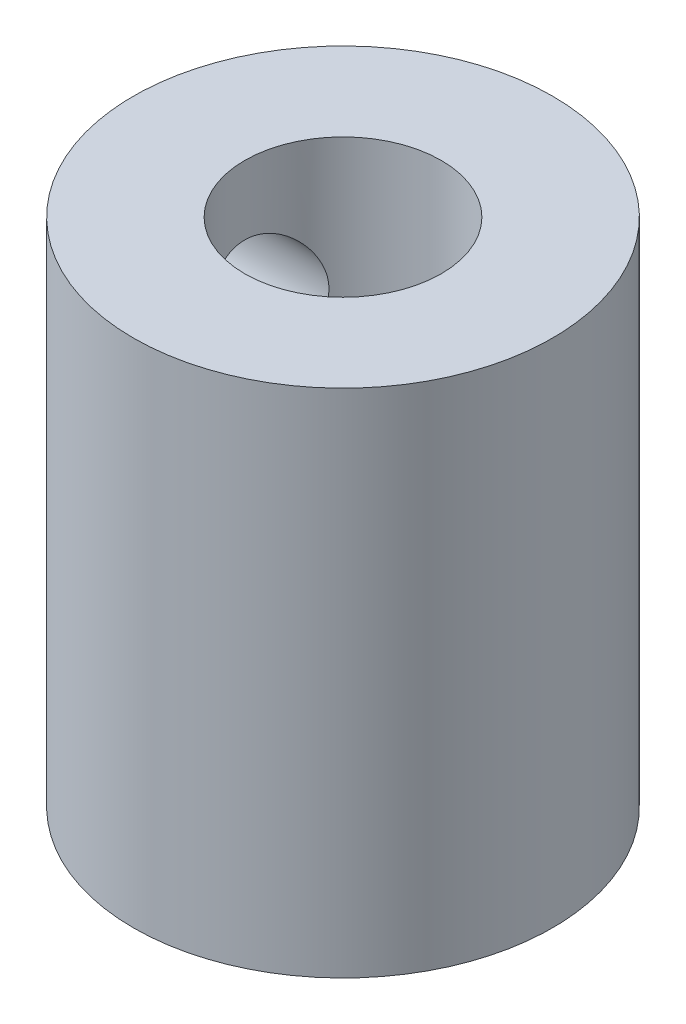
ISO-10303-21;
HEADER;
FILE_DESCRIPTION(('STEP AP214'),'2;1');
FILE_NAME('part.step','',(''),(''),'','','');
FILE_SCHEMA(('AUTOMOTIVE_DESIGN { 1 0 10303 214 1 1 1 1 }'));
ENDSEC;
DATA;
#1=APPLICATION_CONTEXT('core data for automotive mechanical design processes');
#2=APPLICATION_PROTOCOL_DEFINITION('international standard','automotive_design',2000,#1);
#3=PRODUCT_CONTEXT('',#1,'mechanical');
#4=PRODUCT('Part','Part','',(#3));
#5=PRODUCT_RELATED_PRODUCT_CATEGORY('part','',(#4));
#6=PRODUCT_DEFINITION_FORMATION('','',#4);
#7=PRODUCT_DEFINITION_CONTEXT('part definition',#1,'design');
#8=PRODUCT_DEFINITION('design','',#6,#7);
#9=PRODUCT_DEFINITION_SHAPE('','',#8);
#10=(LENGTH_UNIT() NAMED_UNIT(*) SI_UNIT(.MILLI.,.METRE.));
#11=(NAMED_UNIT(*) PLANE_ANGLE_UNIT() SI_UNIT($,.RADIAN.));
#12=(NAMED_UNIT(*) SI_UNIT($,.STERADIAN.) SOLID_ANGLE_UNIT());
#13=UNCERTAINTY_MEASURE_WITH_UNIT(LENGTH_MEASURE(1.E-05),#10,'distance_accuracy_value','');
#14=(GEOMETRIC_REPRESENTATION_CONTEXT(3) GLOBAL_UNCERTAINTY_ASSIGNED_CONTEXT((#13)) GLOBAL_UNIT_ASSIGNED_CONTEXT((#10,
#11,#12)) REPRESENTATION_CONTEXT('',''));
#15=CARTESIAN_POINT('',(0.,0.,0.));
#16=DIRECTION('',(0.,0.,1.));
#17=DIRECTION('',(1.,0.,0.));
#18=AXIS2_PLACEMENT_3D('',#15,#16,#17);
#19=CARTESIAN_POINT('',(0.,74.,0.));
#20=DIRECTION('',(0.,1.,0.));
#21=DIRECTION('',(0.,0.,1.));
#22=AXIS2_PLACEMENT_3D('',#19,#20,#21);
#23=PLANE('',#22);
#24=CARTESIAN_POINT('',(0.,74.,0.));
#25=DIRECTION('',(0.,1.,0.));
#26=DIRECTION('',(0.,0.,1.));
#27=AXIS2_PLACEMENT_3D('',#24,#25,#26);
#28=CIRCLE('',#27,1.3);
#29=CARTESIAN_POINT('',(0.,74.,1.3));
#30=VERTEX_POINT('',#29);
#31=EDGE_CURVE('E125',#30,#30,#28,.T.);
#32=ORIENTED_EDGE('',*,*,#31,.F.);
#33=EDGE_LOOP('',(#32));
#34=FACE_BOUND('',#33,.T.);
#35=CARTESIAN_POINT('',(0.,74.,0.));
#36=DIRECTION('',(0.,1.,0.));
#37=DIRECTION('',(0.,0.,1.));
#38=AXIS2_PLACEMENT_3D('',#35,#36,#37);
#39=CIRCLE('',#38,2.25);
#40=CARTESIAN_POINT('',(0.,74.,2.25));
#41=VERTEX_POINT('',#40);
#42=EDGE_CURVE('E120',#41,#41,#39,.T.);
#43=ORIENTED_EDGE('',*,*,#42,.T.);
#44=EDGE_LOOP('',(#43));
#45=FACE_BOUND('',#44,.T.);
#46=ADVANCED_FACE('F38',(#34,#45),#23,.T.);
#47=CARTESIAN_POINT('',(0.,68.5,0.));
#48=DIRECTION('',(0.,1.,0.));
#49=DIRECTION('',(0.,0.,1.));
#50=AXIS2_PLACEMENT_3D('',#47,#48,#49);
#51=CYLINDRICAL_SURFACE('',#50,4.8);
#52=CARTESIAN_POINT('',(-4.58440598551219,77.2,-1.4224));
#53=CARTESIAN_POINT('',(-4.58440687366464,77.2779905006927,-1.42239891024679));
#54=CARTESIAN_POINT('',(-4.58641793924929,77.355991817505,-1.41596382487332));
#55=CARTESIAN_POINT('',(-4.59421373007542,77.5097172059093,-1.39045776649108));
#56=CARTESIAN_POINT('',(-4.59999978679166,77.5854404641468,-1.37138233507659));
#57=CARTESIAN_POINT('',(-4.61463394781675,77.7323622891536,-1.32129758605142));
#58=CARTESIAN_POINT('',(-4.62347704915413,77.8035680250667,-1.29030775757673));
#59=CARTESIAN_POINT('',(-4.64322217958807,77.9397865957635,-1.21733763273041));
#60=CARTESIAN_POINT('',(-4.6541245004899,78.0047985508802,-1.17535577838866));
#61=CARTESIAN_POINT('',(-4.67713716934944,78.1287915154646,-1.08020560205211));
#62=CARTESIAN_POINT('',(-4.68927277510362,78.1875530051394,-1.02675726157922));
#63=CARTESIAN_POINT('',(-4.71316862128785,78.2954235318547,-0.910791650468689));
#64=CARTESIAN_POINT('',(-4.72492881446101,78.3445313576751,-0.848273243541642));
#65=CARTESIAN_POINT('',(-4.74703510482114,78.4326494203659,-0.714385081904498));
#66=CARTESIAN_POINT('',(-4.75734796804199,78.4714364756348,-0.642862473733131));
#67=CARTESIAN_POINT('',(-4.77510458655067,78.5363477833963,-0.493952506777122));
#68=CARTESIAN_POINT('',(-4.782548944764,78.5624746971969,-0.416566384529534));
#69=CARTESIAN_POINT('',(-4.79355107454164,78.6005994610664,-0.260422116318663));
#70=CARTESIAN_POINT('',(-4.79721167699415,78.6129718677134,-0.181762799484277));
#71=CARTESIAN_POINT('',(-4.80059567792808,78.6244200793448,-0.023405375230265));
#72=CARTESIAN_POINT('',(-4.80031988394474,78.6234986115116,0.0562925157786161));
#73=CARTESIAN_POINT('',(-4.79593516119315,78.6086380733585,0.211839448576014));
#74=CARTESIAN_POINT('',(-4.79194563935893,78.5951045029735,0.287731125190852));
#75=CARTESIAN_POINT('',(-4.78072635892506,78.5560654710242,0.436113343155239));
#76=CARTESIAN_POINT('',(-4.7734963970871,78.5305592585389,0.508603670859288));
#77=CARTESIAN_POINT('',(-4.75644215020036,78.4680203133292,0.649097520065643));
#78=CARTESIAN_POINT('',(-4.74658906549747,78.4308587543089,0.717040056335391));
#79=CARTESIAN_POINT('',(-4.7253356272962,78.346165524846,0.845855531253837));
#80=CARTESIAN_POINT('',(-4.71393491411564,78.2986314421749,0.906726820362723));
#81=CARTESIAN_POINT('',(-4.69030149611501,78.1924335425323,1.02209214025862));
#82=CARTESIAN_POINT('',(-4.67805362756766,78.133418074407,1.07625978478335));
#83=CARTESIAN_POINT('',(-4.6544829848975,78.0070205660565,1.17402028197632));
#84=CARTESIAN_POINT('',(-4.6431602981908,77.9396377367508,1.21761213615209));
#85=CARTESIAN_POINT('',(-4.62265078533774,77.7975766490759,1.29331303589592));
#86=CARTESIAN_POINT('',(-4.61348446437293,77.7228372425279,1.32531329027806));
#87=CARTESIAN_POINT('',(-4.59856985331081,77.5686961428649,1.37617801375682));
#88=CARTESIAN_POINT('',(-4.59282048004923,77.4892959359914,1.39504664587105));
#89=CARTESIAN_POINT('',(-4.58562767618114,77.331187355701,1.41850796927108));
#90=CARTESIAN_POINT('',(-4.58403499578078,77.2525591734428,1.42359573997852));
#91=CARTESIAN_POINT('',(-4.58492369314564,77.0955709907169,1.42073134399132));
#92=CARTESIAN_POINT('',(-4.58740451709816,77.0172109552447,1.41278094989874));
#93=CARTESIAN_POINT('',(-4.59601447010772,76.8650298241311,1.38450633605945));
#94=CARTESIAN_POINT('',(-4.60205023581054,76.7911441324238,1.36449847989358));
#95=CARTESIAN_POINT('',(-4.61699389597871,76.6477826452633,1.31304242587287));
#96=CARTESIAN_POINT('',(-4.62590222647684,76.5783075212173,1.28159249110727));
#97=CARTESIAN_POINT('',(-4.64587862915393,76.4437191179828,1.20719847446517));
#98=CARTESIAN_POINT('',(-4.65699734159412,76.3787686146305,1.16397384513195));
#99=CARTESIAN_POINT('',(-4.68003177915286,76.256861853643,1.06759224099293));
#100=CARTESIAN_POINT('',(-4.69194768992951,76.1999074678457,1.01443294731504));
#101=CARTESIAN_POINT('',(-4.71576310448261,76.0934569962283,0.897367705697397));
#102=CARTESIAN_POINT('',(-4.72764596090186,76.0443112864371,0.833138987540104));
#103=CARTESIAN_POINT('',(-4.74961511741224,75.9574884331214,0.697064415629587));
#104=CARTESIAN_POINT('',(-4.7597015082249,75.9198107103953,0.62521894681485));
#105=CARTESIAN_POINT('',(-4.77687885278478,75.8573564670008,0.476432286256445));
#106=CARTESIAN_POINT('',(-4.78399222477999,75.8324830518034,0.399534485203652));
#107=CARTESIAN_POINT('',(-4.79452106888227,75.7960906090417,0.242402496867359));
#108=CARTESIAN_POINT('',(-4.79793757092694,75.7845678619553,0.162169245302835));
#109=CARTESIAN_POINT('',(-4.80062662737086,75.7754811036243,0.00388569837194404));
#110=CARTESIAN_POINT('',(-4.8000502158879,75.777408359838,-0.0741331942562696));
#111=CARTESIAN_POINT('',(-4.7951725266697,75.7939547742537,-0.228687744416099));
#112=CARTESIAN_POINT('',(-4.79087145137399,75.8085732426745,-0.30522348232766));
#113=CARTESIAN_POINT('',(-4.77906933731412,75.8497750912238,-0.453877147547663));
#114=CARTESIAN_POINT('',(-4.7716015654011,75.8762342379227,-0.526032329670939));
#115=CARTESIAN_POINT('',(-4.75423899923001,75.9402554561604,-0.664917518160095));
#116=CARTESIAN_POINT('',(-4.74434381179487,75.9778193265727,-0.731646643314692));
#117=CARTESIAN_POINT('',(-4.72278151424752,76.0643531936247,-0.860063870335269));
#118=CARTESIAN_POINT('',(-4.71106849585137,76.1136445119723,-0.921527681751999));
#119=CARTESIAN_POINT('',(-4.68734167320662,76.2216519395478,-1.0354818476434));
#120=CARTESIAN_POINT('',(-4.67532778409133,76.2803707338442,-1.08796963680792));
#121=CARTESIAN_POINT('',(-4.65195207147274,76.4076014234107,-1.18400148547145));
#122=CARTESIAN_POINT('',(-4.64061908582834,76.4763471020146,-1.22724359724594));
#123=CARTESIAN_POINT('',(-4.62034370227742,76.6204572872996,-1.30150475851568));
#124=CARTESIAN_POINT('',(-4.61140010602696,76.6958184508429,-1.33252993884928));
#125=CARTESIAN_POINT('',(-4.59784268627801,76.842139113308,-1.37853178679187));
#126=CARTESIAN_POINT('',(-4.59285071504472,76.9126166157705,-1.39493785623814));
#127=CARTESIAN_POINT('',(-4.58613226087978,77.0553932104654,-1.41687144215756));
#128=CARTESIAN_POINT('',(-4.58440516207132,77.1276919565352,-1.42240101035283));
#129=CARTESIAN_POINT('',(-4.58440598551219,77.2,-1.4224));
#130=B_SPLINE_CURVE_WITH_KNOTS('',3,(#52,#53,#54,#55,#56,#57,#58,#59,#60,#61,#62,#63,#64,#65,
#66,#67,#68,#69,#70,#71,#72,#73,#74,#75,#76,#77,#78,#79,#80,#81,#82,#83,#84,#85,#86,#87,#88,#89,
#90,#91,#92,#93,#94,#95,#96,#97,#98,#99,#100,#101,#102,#103,#104,#105,#106,#107,#108,#109,#110,
#111,#112,#113,#114,#115,#116,#117,#118,#119,#120,#121,#122,#123,#124,#125,#126,#127,#128,#129),
.UNSPECIFIED.,.T.,.F.,(4,2,2,2,2,2,2,2,2,2,2,2,2,2,2,2,2,2,2,2,2,2,2,2,2,2,2,2,2,2,2,2,2,2,2,2,
2,2,4),(0.,0.233704869835653,0.467492214164043,0.700898753676049,0.934338393314703,
1.17430671263044,1.41430512095347,1.65913505132481,1.90391349326264,2.14184922505593,
2.37973614603129,2.61022912772106,2.84073656780623,3.07388735370554,3.30709241892286,
3.54907757111414,3.79108556097518,4.03530937960445,4.27945573851537,4.51470693140373,
4.74992614339722,4.97922714197314,5.2085629630383,5.44393043257004,5.67935290851711,
5.9234142793636,6.16746332161047,6.40963736174927,6.6517439154938,6.88474403635868,
7.11773149420756,7.34832974339981,7.57896536809526,7.816848198767,8.05479890216274,
8.29961914080654,8.54431636394445,8.76103417430858,8.97771109952283),.UNSPECIFIED.);
#131=CARTESIAN_POINT('',(-4.58440598551219,77.2,-1.4224));
#132=VERTEX_POINT('',#131);
#133=EDGE_CURVE('E114',#132,#132,#130,.T.);
#134=ORIENTED_EDGE('',*,*,#133,.T.);
#135=EDGE_LOOP('',(#134));
#136=FACE_BOUND('',#135,.T.);
#137=CARTESIAN_POINT('',(-4.58440598551219,71.5,-1.4224));
#138=CARTESIAN_POINT('',(-4.58440687366464,71.5779905006927,-1.42239891024679));
#139=CARTESIAN_POINT('',(-4.58641793924929,71.655991817505,-1.41596382487332));
#140=CARTESIAN_POINT('',(-4.59421373007542,71.8097172059093,-1.39045776649108));
#141=CARTESIAN_POINT('',(-4.59999978679166,71.8854404641468,-1.37138233507659));
#142=CARTESIAN_POINT('',(-4.61463394781675,72.0323622891536,-1.32129758605142));
#143=CARTESIAN_POINT('',(-4.62347704915413,72.1035680250667,-1.29030775757673));
#144=CARTESIAN_POINT('',(-4.64322217958807,72.2397865957635,-1.2173376327304));
#145=CARTESIAN_POINT('',(-4.6541245004899,72.3047985508802,-1.17535577838866));
#146=CARTESIAN_POINT('',(-4.67713716934944,72.4287915154646,-1.08020560205211));
#147=CARTESIAN_POINT('',(-4.68927277510362,72.4875530051394,-1.02675726157922));
#148=CARTESIAN_POINT('',(-4.71316862128785,72.5954235318547,-0.910791650468689));
#149=CARTESIAN_POINT('',(-4.72492881446101,72.6445313576751,-0.848273243541642));
#150=CARTESIAN_POINT('',(-4.74703510482114,72.7326494203659,-0.714385081904498));
#151=CARTESIAN_POINT('',(-4.75734796804199,72.7714364756348,-0.642862473733131));
#152=CARTESIAN_POINT('',(-4.77510458655067,72.8363477833963,-0.493952506777122));
#153=CARTESIAN_POINT('',(-4.782548944764,72.8624746971969,-0.416566384529534));
#154=CARTESIAN_POINT('',(-4.79355107454164,72.9005994610664,-0.260422116318662));
#155=CARTESIAN_POINT('',(-4.79721167699415,72.9129718677134,-0.181762799484276));
#156=CARTESIAN_POINT('',(-4.80059567792808,72.9244200793448,-0.0234053752302643));
#157=CARTESIAN_POINT('',(-4.80031988394474,72.9234986115116,0.0562925157786165));
#158=CARTESIAN_POINT('',(-4.79593516119315,72.9086380733585,0.211839448576014));
#159=CARTESIAN_POINT('',(-4.79194563935893,72.8951045029735,0.287731125190852));
#160=CARTESIAN_POINT('',(-4.78072635892506,72.8560654710243,0.436113343155239));
#161=CARTESIAN_POINT('',(-4.7734963970871,72.8305592585389,0.508603670859288));
#162=CARTESIAN_POINT('',(-4.75644215020036,72.7680203133292,0.64909752006564));
#163=CARTESIAN_POINT('',(-4.74658906549747,72.7308587543089,0.717040056335386));
#164=CARTESIAN_POINT('',(-4.72533562729621,72.646165524846,0.845855531253833));
#165=CARTESIAN_POINT('',(-4.71393491411564,72.5986314421749,0.906726820362721));
#166=CARTESIAN_POINT('',(-4.69030149611501,72.4924335425323,1.02209214025862));
#167=CARTESIAN_POINT('',(-4.67805362756766,72.433418074407,1.07625978478335));
#168=CARTESIAN_POINT('',(-4.6544829848975,72.3070205660566,1.17402028197632));
#169=CARTESIAN_POINT('',(-4.6431602981908,72.2396377367508,1.21761213615209));
#170=CARTESIAN_POINT('',(-4.62265078533774,72.0975766490759,1.29331303589593));
#171=CARTESIAN_POINT('',(-4.61348446437293,72.0228372425279,1.32531329027806));
#172=CARTESIAN_POINT('',(-4.5985698533108,71.8686961428649,1.37617801375682));
#173=CARTESIAN_POINT('',(-4.59282048004923,71.7892959359914,1.39504664587105));
#174=CARTESIAN_POINT('',(-4.58562767618114,71.631187355701,1.41850796927109));
#175=CARTESIAN_POINT('',(-4.58403499578078,71.5525591734428,1.42359573997852));
#176=CARTESIAN_POINT('',(-4.58492369314564,71.3955709907169,1.42073134399132));
#177=CARTESIAN_POINT('',(-4.58740451709816,71.3172109552447,1.41278094989874));
#178=CARTESIAN_POINT('',(-4.59601447010772,71.1650298241311,1.38450633605945));
#179=CARTESIAN_POINT('',(-4.60205023581054,71.0911441324238,1.36449847989358));
#180=CARTESIAN_POINT('',(-4.61699389597871,70.9477826452634,1.31304242587287));
#181=CARTESIAN_POINT('',(-4.62590222647684,70.8783075212173,1.28159249110727));
#182=CARTESIAN_POINT('',(-4.64587862915393,70.7437191179828,1.20719847446517));
#183=CARTESIAN_POINT('',(-4.65699734159412,70.6787686146305,1.16397384513195));
#184=CARTESIAN_POINT('',(-4.68003177915286,70.556861853643,1.06759224099293));
#185=CARTESIAN_POINT('',(-4.69194768992951,70.4999074678457,1.01443294731504));
#186=CARTESIAN_POINT('',(-4.71576310448261,70.3934569962283,0.897367705697394));
#187=CARTESIAN_POINT('',(-4.72764596090186,70.3443112864371,0.833138987540099));
#188=CARTESIAN_POINT('',(-4.74961511741224,70.2574884331215,0.697064415629582));
#189=CARTESIAN_POINT('',(-4.7597015082249,70.2198107103953,0.625218946814848));
#190=CARTESIAN_POINT('',(-4.77687885278478,70.1573564670008,0.476432286256445));
#191=CARTESIAN_POINT('',(-4.78399222477999,70.1324830518034,0.399534485203652));
#192=CARTESIAN_POINT('',(-4.79452106888227,70.0960906090417,0.242402496867359));
#193=CARTESIAN_POINT('',(-4.79793757092694,70.0845678619553,0.162169245302836));
#194=CARTESIAN_POINT('',(-4.80062662737086,70.0754811036243,0.00388569837194345));
#195=CARTESIAN_POINT('',(-4.8000502158879,70.077408359838,-0.0741331942562709));
#196=CARTESIAN_POINT('',(-4.7951725266697,70.0939547742537,-0.2286877444161));
#197=CARTESIAN_POINT('',(-4.79087145137399,70.1085732426745,-0.305223482327659));
#198=CARTESIAN_POINT('',(-4.77906933731412,70.1497750912238,-0.453877147547661));
#199=CARTESIAN_POINT('',(-4.7716015654011,70.1762342379227,-0.526032329670937));
#200=CARTESIAN_POINT('',(-4.75423899923001,70.2402554561603,-0.664917518160093));
#201=CARTESIAN_POINT('',(-4.74434381179487,70.2778193265727,-0.73164664331469));
#202=CARTESIAN_POINT('',(-4.72278151424752,70.3643531936247,-0.860063870335268));
#203=CARTESIAN_POINT('',(-4.71106849585137,70.4136445119723,-0.921527681751999));
#204=CARTESIAN_POINT('',(-4.68734167320662,70.5216519395478,-1.0354818476434));
#205=CARTESIAN_POINT('',(-4.67532778409133,70.5803707338442,-1.08796963680792));
#206=CARTESIAN_POINT('',(-4.65195207147274,70.7076014234107,-1.18400148547144));
#207=CARTESIAN_POINT('',(-4.64061908582834,70.7763471020147,-1.22724359724594));
#208=CARTESIAN_POINT('',(-4.62034370227742,70.9204572872996,-1.30150475851568));
#209=CARTESIAN_POINT('',(-4.61140010602696,70.9958184508429,-1.33252993884928));
#210=CARTESIAN_POINT('',(-4.59784268627801,71.142139113308,-1.37853178679186));
#211=CARTESIAN_POINT('',(-4.59285071504472,71.2126166157706,-1.39493785623813));
#212=CARTESIAN_POINT('',(-4.58613226087978,71.3553932104654,-1.41687144215756));
#213=CARTESIAN_POINT('',(-4.58440516207132,71.4276919565352,-1.42240101035283));
#214=CARTESIAN_POINT('',(-4.58440598551219,71.5,-1.4224));
#215=B_SPLINE_CURVE_WITH_KNOTS('',3,(#137,#138,#139,#140,#141,#142,#143,#144,#145,#146,#147,
#148,#149,#150,#151,#152,#153,#154,#155,#156,#157,#158,#159,#160,#161,#162,#163,#164,#165,#166,
#167,#168,#169,#170,#171,#172,#173,#174,#175,#176,#177,#178,#179,#180,#181,#182,#183,#184,#185,
#186,#187,#188,#189,#190,#191,#192,#193,#194,#195,#196,#197,#198,#199,#200,#201,#202,#203,#204,
#205,#206,#207,#208,#209,#210,#211,#212,#213,#214),.UNSPECIFIED.,.T.,.F.,(4,2,2,2,2,2,2,2,2,2,2,
2,2,2,2,2,2,2,2,2,2,2,2,2,2,2,2,2,2,2,2,2,2,2,2,2,2,2,4),(0.,0.233704869835653,
0.467492214164043,0.700898753676064,0.934338393314703,1.17430671263044,1.41430512095347,
1.65913505132481,1.90391349326264,2.14184922505593,2.37973614603129,2.61022912772106,
2.84073656780623,3.07388735370553,3.30709241892286,3.54907757111414,3.79108556097517,
4.03530937960446,4.27945573851536,4.51470693140375,4.74992614339722,4.97922714197314,
5.20856296303829,5.44393043257005,5.67935290851711,5.92341427936361,6.16746332161047,
6.40963736174927,6.6517439154938,6.88474403635869,7.11773149420756,7.3483297433998,
7.57896536809526,7.81684819876701,8.05479890216274,8.29961914080653,8.54431636394446,
8.76103417430857,8.97771109952284),.UNSPECIFIED.);
#216=CARTESIAN_POINT('',(-4.58440598551219,71.5,-1.4224));
#217=VERTEX_POINT('',#216);
#218=EDGE_CURVE('E79',#217,#217,#215,.T.);
#219=ORIENTED_EDGE('',*,*,#218,.T.);
#220=EDGE_LOOP('',(#219));
#221=FACE_BOUND('',#220,.T.);
#222=CARTESIAN_POINT('',(0.,68.5,0.));
#223=DIRECTION('',(0.,1.,0.));
#224=DIRECTION('',(0.,0.,1.));
#225=AXIS2_PLACEMENT_3D('',#222,#223,#224);
#226=CIRCLE('',#225,4.8);
#227=CARTESIAN_POINT('',(0.,68.5,4.8));
#228=VERTEX_POINT('',#227);
#229=EDGE_CURVE('E75',#228,#228,#226,.T.);
#230=ORIENTED_EDGE('',*,*,#229,.T.);
#231=EDGE_LOOP('',(#230));
#232=FACE_BOUND('',#231,.T.);
#233=CARTESIAN_POINT('',(0.,80.2,0.));
#234=DIRECTION('',(0.,1.,0.));
#235=DIRECTION('',(0.,0.,1.));
#236=AXIS2_PLACEMENT_3D('',#233,#234,#235);
#237=CIRCLE('',#236,4.8);
#238=CARTESIAN_POINT('',(0.,80.2,4.8));
#239=VERTEX_POINT('',#238);
#240=EDGE_CURVE('E119',#239,#239,#237,.T.);
#241=ORIENTED_EDGE('',*,*,#240,.F.);
#242=EDGE_LOOP('',(#241));
#243=FACE_BOUND('',#242,.T.);
#244=ADVANCED_FACE('F40',(#136,#221,#232,#243),#51,.T.);
#245=CARTESIAN_POINT('',(0.,68.5,0.));
#246=DIRECTION('',(0.,1.,0.));
#247=DIRECTION('',(0.,0.,1.));
#248=AXIS2_PLACEMENT_3D('',#245,#246,#247);
#249=PLANE('',#248);
#250=CARTESIAN_POINT('',(0.,68.5,0.));
#251=DIRECTION('',(0.,1.,0.));
#252=DIRECTION('',(0.,0.,1.));
#253=AXIS2_PLACEMENT_3D('',#250,#251,#252);
#254=CIRCLE('',#253,1.3);
#255=CARTESIAN_POINT('',(0.,68.5,1.3));
#256=VERTEX_POINT('',#255);
#257=EDGE_CURVE('E126',#256,#256,#254,.T.);
#258=ORIENTED_EDGE('',*,*,#257,.T.);
#259=EDGE_LOOP('',(#258));
#260=FACE_BOUND('',#259,.T.);
#261=ORIENTED_EDGE('',*,*,#229,.F.);
#262=EDGE_LOOP('',(#261));
#263=FACE_BOUND('',#262,.T.);
#264=ADVANCED_FACE('F135',(#260,#263),#249,.F.);
#265=CARTESIAN_POINT('',(0.,68.5,0.));
#266=DIRECTION('',(0.,1.,0.));
#267=DIRECTION('',(0.,0.,1.));
#268=AXIS2_PLACEMENT_3D('',#265,#266,#267);
#269=CYLINDRICAL_SURFACE('',#268,1.3);
#270=DIRECTION('',(0.,1.,0.));
#271=VECTOR('',#270,1.);
#272=CARTESIAN_POINT('',(0.,68.5,-1.3));
#273=LINE('',#272,#271);
#274=CARTESIAN_POINT('',(0.,72.0772536357616,-1.3));
#275=VERTEX_POINT('',#274);
#276=CARTESIAN_POINT('',(0.,70.9227463642384,-1.3));
#277=VERTEX_POINT('',#276);
#278=EDGE_CURVE('E51',#275,#277,#273,.F.);
#279=ORIENTED_EDGE('',*,*,#278,.T.);
#280=CARTESIAN_POINT('',(0.,70.9227463642384,1.3));
#281=CARTESIAN_POINT('',(0.037229920825782,70.9227390867436,1.29999800896622));
#282=CARTESIAN_POINT('',(0.0744727451855851,70.9190512162519,1.29837708508441));
#283=CARTESIAN_POINT('',(0.147550426951959,70.905286769958,1.29212592012174));
#284=CARTESIAN_POINT('',(0.183378584917671,70.8951829507732,1.28748284427356));
#285=CARTESIAN_POINT('',(0.27057345147867,70.8643839662859,1.27264459312184));
#286=CARTESIAN_POINT('',(0.320636163345426,70.8409166425736,1.26082913055967));
#287=CARTESIAN_POINT('',(0.416772115126733,70.7891716764003,1.23240754282416));
#288=CARTESIAN_POINT('',(0.462828534486893,70.7608751032262,1.21578237809696));
#289=CARTESIAN_POINT('',(0.547133951488667,70.705209350752,1.18004774033849));
#290=CARTESIAN_POINT('',(0.585699693102884,70.6780413149372,1.16136625882408));
#291=CARTESIAN_POINT('',(0.660521558896348,70.6231489682111,1.12050415642257));
#292=CARTESIAN_POINT('',(0.696776082052551,70.5954242888149,1.09832114615709));
#293=CARTESIAN_POINT('',(0.80215342362391,70.5127038454654,1.02653578674185));
#294=CARTESIAN_POINT('',(0.868077162574186,70.4580286874785,0.97161725206705));
#295=CARTESIAN_POINT('',(0.974648102025588,70.3674744236537,0.862734543572929));
#296=CARTESIAN_POINT('',(1.01749329042917,70.3303145166331,0.811967334339006));
#297=CARTESIAN_POINT('',(1.09618131030284,70.2612612307245,0.702093342856163));
#298=CARTESIAN_POINT('',(1.13203634139725,70.2293586917119,0.643001405698947));
#299=CARTESIAN_POINT('',(1.18855548318103,70.1787261755928,0.529625238340446));
#300=CARTESIAN_POINT('',(1.21082402348386,70.158637575282,0.476753301676627));
#301=CARTESIAN_POINT('',(1.24854174366894,70.1244952919047,0.366763166700666));
#302=CARTESIAN_POINT('',(1.26399496496797,70.1104380324474,0.309647508418384));
#303=CARTESIAN_POINT('',(1.28711827277876,70.0893716542412,0.192170531569941));
#304=CARTESIAN_POINT('',(1.29473770244525,70.0824084112156,0.131790713540568));
#305=CARTESIAN_POINT('',(1.30138381337991,70.0763358865969,0.0101708279667989));
#306=CARTESIAN_POINT('',(1.30041396528006,70.0772234327695,-0.0510688821389404));
#307=CARTESIAN_POINT('',(1.29052982848868,70.0862511198338,-0.165838369051285));
#308=CARTESIAN_POINT('',(1.28245487763397,70.0936249935907,-0.219505983026455));
#309=CARTESIAN_POINT('',(1.26002331443776,70.1140493811884,-0.324373271422287));
#310=CARTESIAN_POINT('',(1.24566555657089,70.1271009302202,-0.375572493897755));
#311=CARTESIAN_POINT('',(1.21063917546339,70.1588025671274,-0.476820190034594));
#312=CARTESIAN_POINT('',(1.18970664258891,70.1776860877072,-0.526702660410553));
#313=CARTESIAN_POINT('',(1.14276366930395,70.2197565553878,-0.622028051568684));
#314=CARTESIAN_POINT('',(1.11675115371357,70.242945260971,-0.66746914662179));
#315=CARTESIAN_POINT('',(1.04567714831206,70.3057429443618,-0.776358700518016));
#316=CARTESIAN_POINT('',(0.997795577608096,70.3475706950305,-0.836697115256757));
#317=CARTESIAN_POINT('',(0.894323115090796,70.4359004455815,-0.946526656031954));
#318=CARTESIAN_POINT('',(0.838706827897944,70.482417698123,-0.995980604285597));
#319=CARTESIAN_POINT('',(0.719426518595297,70.5783393107332,-1.08541905762389));
#320=CARTESIAN_POINT('',(0.655596866014293,70.6277866887289,-1.12513773392775));
#321=CARTESIAN_POINT('',(0.554444692691118,70.6999424923697,-1.17643863667231));
#322=CARTESIAN_POINT('',(0.519861569287101,70.7236369100696,-1.19214836876454));
#323=CARTESIAN_POINT('',(0.44857804166351,70.769458203281,-1.2207595688405));
#324=CARTESIAN_POINT('',(0.411880068537188,70.7915868160023,-1.23366418303845));
#325=CARTESIAN_POINT('',(0.34162048048624,70.8297809728255,-1.25476349914674));
#326=CARTESIAN_POINT('',(0.308412073947594,70.8462582314119,-1.26337411543101));
#327=CARTESIAN_POINT('',(0.239928013156155,70.8756322727769,-1.27814573805229));
#328=CARTESIAN_POINT('',(0.204656507503199,70.8885359607286,-1.28431147869876));
#329=CARTESIAN_POINT('',(0.138263196841614,70.9071200934823,-1.29298269984334));
#330=CARTESIAN_POINT('',(0.107447803222823,70.9136528424178,-1.29593072973269));
#331=CARTESIAN_POINT('',(0.0450605513490195,70.9218104195926,-1.29959257343409));
#332=CARTESIAN_POINT('',(0.0134901980209997,70.9234443051364,-1.30031051046068));
#333=CARTESIAN_POINT('',(-0.0494653727520491,70.9214880560041,-1.29944059078731));
#334=CARTESIAN_POINT('',(-0.080850463797194,70.917894693928,-1.29785130956913));
#335=CARTESIAN_POINT('',(-0.142591887368654,70.9061743985114,-1.2925296535671));
#336=CARTESIAN_POINT('',(-0.172945811422518,70.8980375346513,-1.28879258393707));
#337=CARTESIAN_POINT('',(-0.251897385229396,70.8719128528675,-1.27634092250748));
#338=CARTESIAN_POINT('',(-0.299223726155425,70.8509716082578,-1.26596891359934));
#339=CARTESIAN_POINT('',(-0.39028975382781,70.8042920528674,-1.24093580710319));
#340=CARTESIAN_POINT('',(-0.434011628720845,70.7785317621829,-1.22625487441409));
#341=CARTESIAN_POINT('',(-0.516042973786058,70.7263140481999,-1.19395253252606));
#342=CARTESIAN_POINT('',(-0.554519076708286,70.6999816431386,-1.17654843990756));
#343=CARTESIAN_POINT('',(-0.629188828391355,70.6465216221415,-1.13836745390987));
#344=CARTESIAN_POINT('',(-0.665380705860889,70.6193934124104,-1.11758798666943));
#345=CARTESIAN_POINT('',(-0.770714334210021,70.5381273691464,-1.05021588097305));
#346=CARTESIAN_POINT('',(-0.836757009385205,70.4840093934151,-0.998532551614578));
#347=CARTESIAN_POINT('',(-0.946618973884808,70.3915499351499,-0.893529026106998));
#348=CARTESIAN_POINT('',(-0.992190448823296,70.3522848156573,-0.842841266270909));
#349=CARTESIAN_POINT('',(-1.0761738432295,70.278956457161,-0.732553671953606));
#350=CARTESIAN_POINT('',(-1.11459942210383,70.2448833166774,-0.672971241207999));
#351=CARTESIAN_POINT('',(-1.17502581347027,70.1908900850246,-0.559042814593396));
#352=CARTESIAN_POINT('',(-1.19878170654618,70.1695022230114,-0.506329373695333));
#353=CARTESIAN_POINT('',(-1.23949254132734,70.1327082468929,-0.396343712748666));
#354=CARTESIAN_POINT('',(-1.25645136565041,70.117298718009,-0.339074117736606));
#355=CARTESIAN_POINT('',(-1.28253535130243,70.0935543536836,-0.220878175725918));
#356=CARTESIAN_POINT('',(-1.29160432439621,70.0852702673235,-0.159928853428477));
#357=CARTESIAN_POINT('',(-1.30094168790503,70.0767406794139,-0.0368074714629449));
#358=CARTESIAN_POINT('',(-1.30121479157148,70.0764908727097,0.0253639154913668));
#359=CARTESIAN_POINT('',(-1.293429451794,70.0836032119979,0.14157448614114));
#360=CARTESIAN_POINT('',(-1.28631372267579,70.0901040695057,0.195735331907333));
#361=CARTESIAN_POINT('',(-1.26564797273254,70.1089326078307,0.301749849342147));
#362=CARTESIAN_POINT('',(-1.25209699925742,70.1212611513561,0.353603178170957));
#363=CARTESIAN_POINT('',(-1.21877470695071,70.1514519261493,0.455591643138198));
#364=CARTESIAN_POINT('',(-1.19881189866241,70.169484207447,0.505612667349532));
#365=CARTESIAN_POINT('',(-1.1537626477368,70.2099253940321,0.601362042555039));
#366=CARTESIAN_POINT('',(-1.12867381159044,70.2323363436474,0.647088373604919));
#367=CARTESIAN_POINT('',(-1.06022690078156,70.2929663787498,0.75626729495136));
#368=CARTESIAN_POINT('',(-1.01410236871871,70.3333942302067,0.816767765951242));
#369=CARTESIAN_POINT('',(-0.914230709773507,70.4190836902492,0.9272309926878));
#370=CARTESIAN_POINT('',(-0.860462120333623,70.4643588172241,0.977163057683319));
#371=CARTESIAN_POINT('',(-0.745133639647436,70.5580612833542,1.06784692629699));
#372=CARTESIAN_POINT('',(-0.683417544836552,70.6065382314753,1.10834923589221));
#373=CARTESIAN_POINT('',(-0.585737437342928,70.6779104034967,1.16115145558384));
#374=CARTESIAN_POINT('',(-0.552341987629091,70.701467332086,1.17742165582893));
#375=CARTESIAN_POINT('',(-0.483600792311098,70.7473832578635,1.2072843122872));
#376=CARTESIAN_POINT('',(-0.448256655021093,70.7697432137758,1.22087893561219));
#377=CARTESIAN_POINT('',(-0.376494273441081,70.8114191413868,1.24484357757612));
#378=CARTESIAN_POINT('',(-0.340153534604464,70.8308128164627,1.25530760199952));
#379=CARTESIAN_POINT('',(-0.26495465496125,70.8657137691282,1.27329756737348));
#380=CARTESIAN_POINT('',(-0.226102305399966,70.88122961229,1.28083000467418));
#381=CARTESIAN_POINT('',(-0.156016806952943,70.9027094642764,1.29095780638514));
#382=CARTESIAN_POINT('',(-0.125347654156049,70.9100976018552,1.29432054916825));
#383=CARTESIAN_POINT('',(-0.063120422349291,70.9201130020303,1.29883964665283));
#384=CARTESIAN_POINT('',(-0.0315648488663894,70.9227525343569,1.30000168806913));
#385=CARTESIAN_POINT('',(0.,70.9227463642384,1.3));
#386=B_SPLINE_CURVE_WITH_KNOTS('',3,(#280,#281,#282,#283,#284,#285,#286,#287,#288,#289,#290,
#291,#292,#293,#294,#295,#296,#297,#298,#299,#300,#301,#302,#303,#304,#305,#306,#307,#308,#309,
#310,#311,#312,#313,#314,#315,#316,#317,#318,#319,#320,#321,#322,#323,#324,#325,#326,#327,#328,
#329,#330,#331,#332,#333,#334,#335,#336,#337,#338,#339,#340,#341,#342,#343,#344,#345,#346,#347,
#348,#349,#350,#351,#352,#353,#354,#355,#356,#357,#358,#359,#360,#361,#362,#363,#364,#365,#366,
#367,#368,#369,#370,#371,#372,#373,#374,#375,#376,#377,#378,#379,#380,#381,#382,#383,#384,#385),
.UNSPECIFIED.,.T.,.F.,(4,2,2,2,2,2,2,2,2,2,2,2,2,2,2,2,2,2,2,2,2,2,2,2,2,2,2,2,2,2,2,2,2,2,2,2,
2,2,2,2,2,2,2,2,2,2,2,2,2,2,2,2,4),(0.,0.111536231422695,0.223549263840257,0.392204135505314,
0.561535995266384,0.71354924507306,0.865666677947235,1.16918025225919,1.39677941193043,
1.62397772490513,1.8056140187272,1.98714245872502,2.169837498362,2.35245872058094,
2.51602846505055,2.67962804513536,2.85088435137268,3.02221076293706,3.28370921728119,
3.54608746127482,3.81498523690544,3.94917841250533,4.08322029171083,4.1971907018843,
4.31093932676358,4.40545973213543,4.49980527456948,4.5942090924254,4.68882005652517,
4.84626221357535,5.00444079948067,5.15353435877274,5.30274214635774,5.60061510588237,
5.8358141471427,6.07055887658674,6.25478525861465,6.43890625645652,6.62432799889445,
6.80965038175839,6.97392518501885,7.13822431450575,7.30797540884891,7.47780594738575,
7.73482896373301,7.99258843568849,8.25654319270548,8.38840630561431,8.52016217103995,
8.64743348946599,8.77442114864672,8.8692308549341,8.96379523245343),.UNSPECIFIED.);
#387=CARTESIAN_POINT('',(0.,70.9227463642383,1.29999999999999));
#388=VERTEX_POINT('',#387);
#389=EDGE_CURVE('E11',#277,#388,#386,.T.);
#390=ORIENTED_EDGE('',*,*,#389,.T.);
#391=DIRECTION('',(0.,1.,0.));
#392=VECTOR('',#391,1.);
#393=CARTESIAN_POINT('',(0.,68.5,1.3));
#394=LINE('',#393,#392);
#395=CARTESIAN_POINT('',(0.,72.0772536357617,1.29999999999999));
#396=VERTEX_POINT('',#395);
#397=EDGE_CURVE('E74',#388,#396,#394,.T.);
#398=ORIENTED_EDGE('',*,*,#397,.T.);
#399=CARTESIAN_POINT('',(0.,72.0772536357616,1.3));
#400=CARTESIAN_POINT('',(-0.037229920825782,72.0772609132564,1.29999800896622));
#401=CARTESIAN_POINT('',(-0.0744727451855851,72.0809487837481,1.29837708508441));
#402=CARTESIAN_POINT('',(-0.147550426951959,72.094713230042,1.29212592012174));
#403=CARTESIAN_POINT('',(-0.183378584917671,72.1048170492268,1.28748284427356));
#404=CARTESIAN_POINT('',(-0.27057345147867,72.135616033714,1.27264459312184));
#405=CARTESIAN_POINT('',(-0.320636163345426,72.1590833574264,1.26082913055967));
#406=CARTESIAN_POINT('',(-0.416772115126733,72.2108283235996,1.23240754282416));
#407=CARTESIAN_POINT('',(-0.462828534486893,72.2391248967738,1.21578237809696));
#408=CARTESIAN_POINT('',(-0.547133951488667,72.294790649248,1.18004774033849));
#409=CARTESIAN_POINT('',(-0.585699693102884,72.3219586850628,1.16136625882408));
#410=CARTESIAN_POINT('',(-0.660521558896348,72.3768510317889,1.12050415642257));
#411=CARTESIAN_POINT('',(-0.696776082052551,72.4045757111851,1.09832114615709));
#412=CARTESIAN_POINT('',(-0.80215342362391,72.4872961545346,1.02653578674185));
#413=CARTESIAN_POINT('',(-0.868077162574186,72.5419713125215,0.97161725206705));
#414=CARTESIAN_POINT('',(-0.974648102025588,72.6325255763463,0.862734543572929));
#415=CARTESIAN_POINT('',(-1.01749329042917,72.6696854833669,0.811967334339006));
#416=CARTESIAN_POINT('',(-1.09618131030284,72.7387387692755,0.702093342856163));
#417=CARTESIAN_POINT('',(-1.13203634139725,72.770641308288,0.643001405698947));
#418=CARTESIAN_POINT('',(-1.18855548318103,72.8212738244072,0.529625238340446));
#419=CARTESIAN_POINT('',(-1.21082402348386,72.841362424718,0.476753301676627));
#420=CARTESIAN_POINT('',(-1.24854174366894,72.8755047080953,0.366763166700666));
#421=CARTESIAN_POINT('',(-1.26399496496797,72.8895619675526,0.309647508418384));
#422=CARTESIAN_POINT('',(-1.28711827277876,72.9106283457588,0.192170531569941));
#423=CARTESIAN_POINT('',(-1.29473770244525,72.9175915887844,0.131790713540568));
#424=CARTESIAN_POINT('',(-1.30138381337991,72.9236641134031,0.0101708279667984));
#425=CARTESIAN_POINT('',(-1.30041396528006,72.9227765672305,-0.0510688821389407));
#426=CARTESIAN_POINT('',(-1.29052982848868,72.9137488801662,-0.165838369051285));
#427=CARTESIAN_POINT('',(-1.28245487763397,72.9063750064093,-0.219505983026455));
#428=CARTESIAN_POINT('',(-1.26002331443776,72.8859506188116,-0.324373271422287));
#429=CARTESIAN_POINT('',(-1.24566555657089,72.8728990697798,-0.375572493897755));
#430=CARTESIAN_POINT('',(-1.21063917546339,72.8411974328726,-0.476820190034594));
#431=CARTESIAN_POINT('',(-1.18970664258891,72.8223139122928,-0.526702660410553));
#432=CARTESIAN_POINT('',(-1.14276366930395,72.7802434446122,-0.622028051568684));
#433=CARTESIAN_POINT('',(-1.11675115371357,72.757054739029,-0.66746914662179));
#434=CARTESIAN_POINT('',(-1.04567714831206,72.6942570556381,-0.776358700518016));
#435=CARTESIAN_POINT('',(-0.997795577608096,72.6524293049695,-0.836697115256757));
#436=CARTESIAN_POINT('',(-0.894323115090796,72.5640995544185,-0.946526656031954));
#437=CARTESIAN_POINT('',(-0.838706827897944,72.517582301877,-0.995980604285597));
#438=CARTESIAN_POINT('',(-0.719426518595297,72.4216606892668,-1.08541905762389));
#439=CARTESIAN_POINT('',(-0.655596866014293,72.3722133112711,-1.12513773392775));
#440=CARTESIAN_POINT('',(-0.554444692691118,72.3000575076303,-1.17643863667231));
#441=CARTESIAN_POINT('',(-0.519861569287101,72.2763630899304,-1.19214836876454));
#442=CARTESIAN_POINT('',(-0.44857804166351,72.230541796719,-1.2207595688405));
#443=CARTESIAN_POINT('',(-0.411880068537187,72.2084131839977,-1.23366418303845));
#444=CARTESIAN_POINT('',(-0.34162048048624,72.1702190271745,-1.25476349914674));
#445=CARTESIAN_POINT('',(-0.308412073947594,72.153741768588,-1.26337411543101));
#446=CARTESIAN_POINT('',(-0.239928013156155,72.1243677272231,-1.27814573805229));
#447=CARTESIAN_POINT('',(-0.204656507503199,72.1114640392713,-1.28431147869876));
#448=CARTESIAN_POINT('',(-0.138263196841614,72.0928799065177,-1.29298269984334));
#449=CARTESIAN_POINT('',(-0.107447803222823,72.0863471575822,-1.29593072973269));
#450=CARTESIAN_POINT('',(-0.0450605513490195,72.0781895804074,-1.29959257343409));
#451=CARTESIAN_POINT('',(-0.0134901980209997,72.0765556948636,-1.30031051046068));
#452=CARTESIAN_POINT('',(0.0494653727520474,72.0785119439959,-1.29944059078731));
#453=CARTESIAN_POINT('',(0.0808504637971906,72.082105306072,-1.29785130956913));
#454=CARTESIAN_POINT('',(0.142591887368651,72.0938256014886,-1.2925296535671));
#455=CARTESIAN_POINT('',(0.172945811422517,72.1019624653486,-1.28879258393707));
#456=CARTESIAN_POINT('',(0.251897385229395,72.1280871471325,-1.27634092250748));
#457=CARTESIAN_POINT('',(0.299223726155422,72.1490283917422,-1.26596891359934));
#458=CARTESIAN_POINT('',(0.390289753827807,72.1957079471326,-1.24093580710319));
#459=CARTESIAN_POINT('',(0.434011628720844,72.2214682378171,-1.22625487441409));
#460=CARTESIAN_POINT('',(0.516042973786058,72.2736859518001,-1.19395253252606));
#461=CARTESIAN_POINT('',(0.554519076708287,72.3000183568614,-1.17654843990756));
#462=CARTESIAN_POINT('',(0.629188828391355,72.3534783778585,-1.13836745390987));
#463=CARTESIAN_POINT('',(0.665380705860889,72.3806065875896,-1.11758798666943));
#464=CARTESIAN_POINT('',(0.770714334210021,72.4618726308536,-1.05021588097305));
#465=CARTESIAN_POINT('',(0.836757009385204,72.5159906065848,-0.998532551614578));
#466=CARTESIAN_POINT('',(0.946618973884803,72.6084500648501,-0.893529026107003));
#467=CARTESIAN_POINT('',(0.992190448823288,72.6477151843427,-0.842841266270918));
#468=CARTESIAN_POINT('',(1.07617384322949,72.7210435428389,-0.732553671953617));
#469=CARTESIAN_POINT('',(1.11459942210383,72.7551166833226,-0.672971241208005));
#470=CARTESIAN_POINT('',(1.17502581347027,72.8091099149754,-0.559042814593397));
#471=CARTESIAN_POINT('',(1.19878170654618,72.8304977769885,-0.506329373695336));
#472=CARTESIAN_POINT('',(1.23949254132733,72.8672917531071,-0.396343712748669));
#473=CARTESIAN_POINT('',(1.25645136565041,72.882701281991,-0.339074117736607));
#474=CARTESIAN_POINT('',(1.28253535130243,72.9064456463164,-0.220878175725918));
#475=CARTESIAN_POINT('',(1.29160432439621,72.9147297326765,-0.159928853428477));
#476=CARTESIAN_POINT('',(1.30094168790503,72.9232593205861,-0.0368074714629449));
#477=CARTESIAN_POINT('',(1.30121479157148,72.9235091272903,0.0253639154913668));
#478=CARTESIAN_POINT('',(1.293429451794,72.9163967880021,0.141574486141139));
#479=CARTESIAN_POINT('',(1.28631372267579,72.9098959304943,0.195735331907332));
#480=CARTESIAN_POINT('',(1.26564797273254,72.8910673921692,0.301749849342146));
#481=CARTESIAN_POINT('',(1.25209699925742,72.8787388486439,0.353603178170956));
#482=CARTESIAN_POINT('',(1.21877470695071,72.8485480738507,0.4555916431382));
#483=CARTESIAN_POINT('',(1.19881189866241,72.830515792553,0.505612667349535));
#484=CARTESIAN_POINT('',(1.15376264773679,72.7900746059679,0.601362042555042));
#485=CARTESIAN_POINT('',(1.12867381159044,72.7676636563526,0.64708837360492));
#486=CARTESIAN_POINT('',(1.06022690078156,72.7070336212502,0.75626729495136));
#487=CARTESIAN_POINT('',(1.01410236871871,72.6666057697933,0.816767765951242));
#488=CARTESIAN_POINT('',(0.914230709773507,72.5809163097508,0.9272309926878));
#489=CARTESIAN_POINT('',(0.860462120333623,72.5356411827759,0.977163057683319));
#490=CARTESIAN_POINT('',(0.745133639647436,72.4419387166458,1.06784692629699));
#491=CARTESIAN_POINT('',(0.683417544836552,72.3934617685247,1.10834923589221));
#492=CARTESIAN_POINT('',(0.585737437342928,72.3220895965033,1.16115145558384));
#493=CARTESIAN_POINT('',(0.552341987629091,72.298532667914,1.17742165582893));
#494=CARTESIAN_POINT('',(0.483600792311098,72.2526167421364,1.2072843122872));
#495=CARTESIAN_POINT('',(0.448256655021093,72.2302567862242,1.22087893561219));
#496=CARTESIAN_POINT('',(0.376494273441081,72.1885808586131,1.24484357757612));
#497=CARTESIAN_POINT('',(0.340153534604464,72.1691871835373,1.25530760199952));
#498=CARTESIAN_POINT('',(0.26495465496125,72.1342862308718,1.27329756737348));
#499=CARTESIAN_POINT('',(0.226102305399966,72.11877038771,1.28083000467418));
#500=CARTESIAN_POINT('',(0.156016806952943,72.0972905357236,1.29095780638514));
#501=CARTESIAN_POINT('',(0.125347654156049,72.0899023981447,1.29432054916825));
#502=CARTESIAN_POINT('',(0.063120422349291,72.0798869979697,1.29883964665283));
#503=CARTESIAN_POINT('',(0.0315648488663894,72.0772474656431,1.30000168806913));
#504=CARTESIAN_POINT('',(0.,72.0772536357616,1.3));
#505=B_SPLINE_CURVE_WITH_KNOTS('',3,(#399,#400,#401,#402,#403,#404,#405,#406,#407,#408,#409,
#410,#411,#412,#413,#414,#415,#416,#417,#418,#419,#420,#421,#422,#423,#424,#425,#426,#427,#428,
#429,#430,#431,#432,#433,#434,#435,#436,#437,#438,#439,#440,#441,#442,#443,#444,#445,#446,#447,
#448,#449,#450,#451,#452,#453,#454,#455,#456,#457,#458,#459,#460,#461,#462,#463,#464,#465,#466,
#467,#468,#469,#470,#471,#472,#473,#474,#475,#476,#477,#478,#479,#480,#481,#482,#483,#484,#485,
#486,#487,#488,#489,#490,#491,#492,#493,#494,#495,#496,#497,#498,#499,#500,#501,#502,#503,#504),
.UNSPECIFIED.,.T.,.F.,(4,2,2,2,2,2,2,2,2,2,2,2,2,2,2,2,2,2,2,2,2,2,2,2,2,2,2,2,2,2,2,2,2,2,2,2,
2,2,2,2,2,2,2,2,2,2,2,2,2,2,2,2,4),(0.,0.111536231422695,0.223549263840257,0.392204135505314,
0.561535995266384,0.71354924507306,0.865666677947235,1.16918025225919,1.39677941193043,
1.62397772490513,1.8056140187272,1.98714245872502,2.169837498362,2.35245872058094,
2.51602846505055,2.67962804513536,2.85088435137268,3.02221076293706,3.28370921728119,
3.54608746127482,3.81498523690544,3.94917841250533,4.08322029171084,4.1971907018843,
4.31093932676358,4.40545973213543,4.49980527456948,4.5942090924254,4.68882005652518,
4.84626221357534,5.00444079948067,5.15353435877274,5.30274214635775,5.60061510588237,
5.83581414714267,6.07055887658674,6.25478525861465,6.43890625645652,6.62432799889445,
6.80965038175839,6.97392518501885,7.13822431450575,7.30797540884891,7.47780594738575,
7.73482896373301,7.99258843568849,8.25654319270548,8.38840630561431,8.52016217103995,
8.647433489466,8.77442114864672,8.8692308549341,8.96379523245343),.UNSPECIFIED.);
#506=EDGE_CURVE('E67',#396,#275,#505,.T.);
#507=ORIENTED_EDGE('',*,*,#506,.T.);
#508=EDGE_LOOP('',(#279,#390,#398,#507));
#509=FACE_BOUND('',#508,.T.);
#510=ORIENTED_EDGE('',*,*,#257,.F.);
#511=EDGE_LOOP('',(#510));
#512=FACE_BOUND('',#511,.T.);
#513=ORIENTED_EDGE('',*,*,#31,.T.);
#514=EDGE_LOOP('',(#513));
#515=FACE_BOUND('',#514,.T.);
#516=ADVANCED_FACE('F81',(#509,#512,#515),#269,.F.);
#517=CARTESIAN_POINT('',(0.,80.2,0.));
#518=DIRECTION('',(0.,1.,0.));
#519=DIRECTION('',(0.,0.,1.));
#520=AXIS2_PLACEMENT_3D('',#517,#518,#519);
#521=PLANE('',#520);
#522=ORIENTED_EDGE('',*,*,#240,.T.);
#523=EDGE_LOOP('',(#522));
#524=FACE_BOUND('',#523,.T.);
#525=CARTESIAN_POINT('',(0.,80.2,0.));
#526=DIRECTION('',(0.,1.,0.));
#527=DIRECTION('',(0.,0.,1.));
#528=AXIS2_PLACEMENT_3D('',#525,#526,#527);
#529=CIRCLE('',#528,2.25);
#530=CARTESIAN_POINT('',(0.,80.2,2.25));
#531=VERTEX_POINT('',#530);
#532=EDGE_CURVE('E116',#531,#531,#529,.T.);
#533=ORIENTED_EDGE('',*,*,#532,.F.);
#534=EDGE_LOOP('',(#533));
#535=FACE_BOUND('',#534,.T.);
#536=ADVANCED_FACE('F142',(#524,#535),#521,.T.);
#537=CARTESIAN_POINT('',(0.,80.2,0.));
#538=DIRECTION('',(0.,-1.,0.));
#539=DIRECTION('',(0.,0.,-1.));
#540=AXIS2_PLACEMENT_3D('',#537,#538,#539);
#541=CYLINDRICAL_SURFACE('',#540,2.25);
#542=CARTESIAN_POINT('',(-1.74335258625443,77.2,-1.4224));
#543=CARTESIAN_POINT('',(-1.7433632023965,77.2704752164432,-1.42239338778137));
#544=CARTESIAN_POINT('',(-1.74770664179316,77.3410520550449,-1.41711417283698));
#545=CARTESIAN_POINT('',(-1.76430580511318,77.4798026550813,-1.39638338274609));
#546=CARTESIAN_POINT('',(-1.77658195750128,77.5479697314661,-1.38090554188227));
#547=CARTESIAN_POINT('',(-1.80695995796897,77.6794720050266,-1.34090038696447));
#548=CARTESIAN_POINT('',(-1.8250101122143,77.7428441289296,-1.31645309998327));
#549=CARTESIAN_POINT('',(-1.86481360875411,77.8645026037351,-1.25943527258436));
#550=CARTESIAN_POINT('',(-1.8865671973786,77.9227886159499,-1.22686419175402));
#551=CARTESIAN_POINT('',(-1.93493381055222,78.0414385084447,-1.14930159533023));
#552=CARTESIAN_POINT('',(-1.96180353809403,78.1009837627656,-1.10321748169376));
#553=CARTESIAN_POINT('',(-2.01530175213025,78.2121951415625,-1.00216455643068));
#554=CARTESIAN_POINT('',(-2.04193000562886,78.263854289177,-0.947187965138104));
#555=CARTESIAN_POINT('',(-2.09586416304232,78.3642059389303,-0.821631431792651));
#556=CARTESIAN_POINT('',(-2.12284171375635,78.4117284275833,-0.749961031168399));
#557=CARTESIAN_POINT('',(-2.1706477015759,78.4936534595629,-0.597610370822534));
#558=CARTESIAN_POINT('',(-2.19148234508671,78.5280692553912,-0.516939319200358));
#559=CARTESIAN_POINT('',(-2.22271270966779,78.5789605429832,-0.35768064429152));
#560=CARTESIAN_POINT('',(-2.23396545538456,78.5969238008624,-0.279741034915875));
#561=CARTESIAN_POINT('',(-2.2481343055109,78.6194755484638,-0.12123500524914));
#562=CARTESIAN_POINT('',(-2.25105945453363,78.6240785488846,-0.0406715310402039));
#563=CARTESIAN_POINT('',(-2.24843702902831,78.6199252186348,0.108839796376444));
#564=CARTESIAN_POINT('',(-2.24399692567575,78.6129152619696,0.177864694820433));
#565=CARTESIAN_POINT('',(-2.22909302833532,78.5891234202447,0.313527473749945));
#566=CARTESIAN_POINT('',(-2.21862877971816,78.5723407976618,0.38016517367551));
#567=CARTESIAN_POINT('',(-2.19254834984939,78.5297640681023,0.509506879312237));
#568=CARTESIAN_POINT('',(-2.17692421367987,78.5039560431608,0.572204632097518));
#569=CARTESIAN_POINT('',(-2.14172421614603,78.4443004784217,0.692420111564969));
#570=CARTESIAN_POINT('',(-2.12214748888845,78.4104511767358,0.749936699210767));
#571=CARTESIAN_POINT('',(-2.07774016001253,78.3309072787451,0.865921370800167));
#572=CARTESIAN_POINT('',(-2.05255844458699,78.2842583258855,0.923599300405532));
#573=CARTESIAN_POINT('',(-2.00086842171766,78.1829031079331,1.03081382639542));
#574=CARTESIAN_POINT('',(-1.97435819481733,78.1281849489798,1.08033817250934));
#575=CARTESIAN_POINT('',(-1.91872576883378,78.0035894526205,1.17663872697857));
#576=CARTESIAN_POINT('',(-1.88973342731561,77.9326629230446,1.22214375038003));
#577=CARTESIAN_POINT('',(-1.83673834326516,77.782433662761,1.30043590358114));
#578=CARTESIAN_POINT('',(-1.81272651156257,77.7031465958275,1.33324629685923));
#579=CARTESIAN_POINT('',(-1.77915737532966,77.5599760333721,1.37755439447627));
#580=CARTESIAN_POINT('',(-1.76745220410691,77.4976368377985,1.39240423505552));
#581=CARTESIAN_POINT('',(-1.75056574027697,77.3706978187996,1.41358039139375));
#582=CARTESIAN_POINT('',(-1.74537513249755,77.3061013592929,1.41991887844383));
#583=CARTESIAN_POINT('',(-1.74230360035694,77.1763000888273,1.4236874702573));
#584=CARTESIAN_POINT('',(-1.74444163708821,77.1110941357744,1.4210944668681));
#585=CARTESIAN_POINT('',(-1.75572444860947,76.9822306491298,1.40712712333303));
#586=CARTESIAN_POINT('',(-1.76487506688839,76.9185744525952,1.39574545965578));
#587=CARTESIAN_POINT('',(-1.78860577240698,76.7957767745284,1.36519177315528));
#588=CARTESIAN_POINT('',(-1.80306527438794,76.7365677674284,1.34619196645411));
#589=CARTESIAN_POINT('',(-1.83583341511461,76.6220529988413,1.30114940466387));
#590=CARTESIAN_POINT('',(-1.85414340376014,76.5667486153397,1.27510417867938));
#591=CARTESIAN_POINT('',(-1.89680551739695,76.4502845008933,1.21094220911524));
#592=CARTESIAN_POINT('',(-1.92164197270316,76.3900512842761,1.17146627056416));
#593=CARTESIAN_POINT('',(-1.97224167885444,76.2763925653654,1.08412015571172));
#594=CARTESIAN_POINT('',(-1.99800588240078,76.2229743326808,1.0362411429451));
#595=CARTESIAN_POINT('',(-2.05268481379133,76.1152217586275,0.923860542869583));
#596=CARTESIAN_POINT('',(-2.08139272209392,76.062268769096,0.857916962216476));
#597=CARTESIAN_POINT('',(-2.13424388219614,75.9682420420555,0.716379081637279));
#598=CARTESIAN_POINT('',(-2.15838894336237,75.9271635923398,0.64078862712018));
#599=CARTESIAN_POINT('',(-2.1982404622354,75.860728218662,0.486065928684693));
#600=CARTESIAN_POINT('',(-2.21433778631261,75.8346312954428,0.407356697478641));
#601=CARTESIAN_POINT('',(-2.23806471670832,75.7964745088302,0.245415886732835));
#602=CARTESIAN_POINT('',(-2.24570669543581,75.7843941342512,0.16219110234943));
#603=CARTESIAN_POINT('',(-2.25111604549026,75.7758340178593,0.00733727529733238));
#604=CARTESIAN_POINT('',(-2.25020380274617,75.7772683939195,-0.0641387162088661));
#605=CARTESIAN_POINT('',(-2.24170040538568,75.7907551840853,-0.205669708190515));
#606=CARTESIAN_POINT('',(-2.23410969638352,75.8028068897599,-0.275724803154868));
#607=CARTESIAN_POINT('',(-2.21339906684438,75.836174869049,-0.40960204087524));
#608=CARTESIAN_POINT('',(-2.20051630608631,75.8570948663594,-0.473561779740243));
#609=CARTESIAN_POINT('',(-2.17028687532549,75.9072254318455,-0.596989270315698));
#610=CARTESIAN_POINT('',(-2.15293950169173,75.9364373069107,-0.656456312056324));
#611=CARTESIAN_POINT('',(-2.11305708682053,76.0055916101103,-0.775783272390355));
#612=CARTESIAN_POINT('',(-2.09017375700048,76.0463235604981,-0.835067204471539));
#613=CARTESIAN_POINT('',(-2.0421959841158,76.1357118957419,-0.946370512172054));
#614=CARTESIAN_POINT('',(-2.01709911505997,76.1843770259906,-0.9983817516033));
#615=CARTESIAN_POINT('',(-1.96282801526684,76.2965721993782,-1.10167621488421));
#616=CARTESIAN_POINT('',(-1.93360149287997,76.361236476232,-1.15170554181887));
#617=CARTESIAN_POINT('',(-1.87793466423197,76.4990574061358,-1.24040484889758));
#618=CARTESIAN_POINT('',(-1.85149310031213,76.5722101942206,-1.27907997071027));
#619=CARTESIAN_POINT('',(-1.8102203116909,76.7091801967712,-1.33662774940803));
#620=CARTESIAN_POINT('',(-1.7941147087926,76.7715711697071,-1.35797735528613));
#621=CARTESIAN_POINT('',(-1.767907544597,76.8998069808572,-1.39193126153905));
#622=CARTESIAN_POINT('',(-1.75778750876215,76.9656405015935,-1.40456249167466));
#623=CARTESIAN_POINT('',(-1.74873978177137,77.060060023539,-1.41577656418758));
#624=CARTESIAN_POINT('',(-1.74672728671855,77.0879439894885,-1.41825567848881));
#625=CARTESIAN_POINT('',(-1.74403139542122,77.1438799016979,-1.42156893527307));
#626=CARTESIAN_POINT('',(-1.74334835817192,77.1719318912787,-1.42240263344309));
#627=CARTESIAN_POINT('',(-1.74335258625443,77.2,-1.4224));
#628=B_SPLINE_CURVE_WITH_KNOTS('',3,(#542,#543,#544,#545,#546,#547,#548,#549,#550,#551,#552,
#553,#554,#555,#556,#557,#558,#559,#560,#561,#562,#563,#564,#565,#566,#567,#568,#569,#570,#571,
#572,#573,#574,#575,#576,#577,#578,#579,#580,#581,#582,#583,#584,#585,#586,#587,#588,#589,#590,
#591,#592,#593,#594,#595,#596,#597,#598,#599,#600,#601,#602,#603,#604,#605,#606,#607,#608,#609,
#610,#611,#612,#613,#614,#615,#616,#617,#618,#619,#620,#621,#622,#623,#624,#625,#626,#627),
.UNSPECIFIED.,.T.,.F.,(4,2,2,2,2,2,2,2,2,2,2,2,2,2,2,2,2,2,2,2,2,2,2,2,2,2,2,2,2,2,2,2,2,2,2,2,
2,2,2,2,2,2,4),(0.,0.211296874444547,0.423140064675786,0.633137374458484,0.843148657451431,
1.08207203716073,1.32120558312173,1.59011029508617,1.85874238434182,2.09958060683915,
2.34015715466553,2.54772421502944,2.7553069420868,2.96321120190154,3.17116105677159,
3.40526509260569,3.63971770784246,3.90578657838379,4.17136552994279,4.3659880151698,
4.5603318915282,4.75517896470838,4.95018857808958,5.14101815184731,5.33191473831169,
5.55961198610224,5.7875501252424,6.05414913355296,6.32064220094306,6.57248819502137,
6.82396518235031,7.03735060798203,7.2507217967558,7.45542450583933,7.66015949621425,
7.88573144229983,8.1115537575901,8.3708942333787,8.63011708693759,8.8330034393886,
9.03526026741083,9.11939059183271,9.20354363092489),.UNSPECIFIED.);
#629=CARTESIAN_POINT('',(-1.74335258625443,77.2,-1.4224));
#630=VERTEX_POINT('',#629);
#631=EDGE_CURVE('E88',#630,#630,#628,.T.);
#632=ORIENTED_EDGE('',*,*,#631,.F.);
#633=EDGE_LOOP('',(#632));
#634=FACE_BOUND('',#633,.T.);
#635=ORIENTED_EDGE('',*,*,#532,.T.);
#636=EDGE_LOOP('',(#635));
#637=FACE_BOUND('',#636,.T.);
#638=ORIENTED_EDGE('',*,*,#42,.F.);
#639=EDGE_LOOP('',(#638));
#640=FACE_BOUND('',#639,.T.);
#641=ADVANCED_FACE('F152',(#634,#637,#640),#541,.F.);
#642=CARTESIAN_POINT('',(-4.801,77.2,0.));
#643=DIRECTION('',(1.,0.,0.));
#644=DIRECTION('',(0.,0.,-1.));
#645=AXIS2_PLACEMENT_3D('',#642,#643,#644);
#646=CYLINDRICAL_SURFACE('',#645,1.4224);
#647=ORIENTED_EDGE('',*,*,#631,.T.);
#648=EDGE_LOOP('',(#647));
#649=FACE_BOUND('',#648,.T.);
#650=ORIENTED_EDGE('',*,*,#133,.F.);
#651=EDGE_LOOP('',(#650));
#652=FACE_BOUND('',#651,.T.);
#653=ADVANCED_FACE('F154',(#649,#652),#646,.F.);
#654=CARTESIAN_POINT('',(0.,71.5,0.));
#655=DIRECTION('',(1.,0.,0.));
#656=DIRECTION('',(0.,0.,-1.));
#657=AXIS2_PLACEMENT_3D('',#654,#655,#656);
#658=PLANE('',#657);
#659=CARTESIAN_POINT('',(0.,71.5,0.));
#660=DIRECTION('',(1.,0.,0.));
#661=DIRECTION('',(0.,0.,-1.));
#662=AXIS2_PLACEMENT_3D('',#659,#660,#661);
#663=CIRCLE('',#662,1.4224);
#664=EDGE_CURVE('E58',#277,#275,#663,.T.);
#665=ORIENTED_EDGE('',*,*,#664,.F.);
#666=ORIENTED_EDGE('',*,*,#278,.F.);
#667=EDGE_LOOP('',(#665,#666));
#668=FACE_BOUND('',#667,.T.);
#669=ADVANCED_FACE('F103',(#668),#658,.F.);
#670=EDGE_CURVE('E70',#396,#388,#663,.T.);
#671=ORIENTED_EDGE('',*,*,#670,.F.);
#672=ORIENTED_EDGE('',*,*,#397,.F.);
#673=EDGE_LOOP('',(#671,#672));
#674=FACE_BOUND('',#673,.T.);
#675=ADVANCED_FACE('F78',(#674),#658,.F.);
#676=CARTESIAN_POINT('',(-4.801,71.5,0.));
#677=DIRECTION('',(1.,0.,0.));
#678=DIRECTION('',(0.,0.,-1.));
#679=AXIS2_PLACEMENT_3D('',#676,#677,#678);
#680=CYLINDRICAL_SURFACE('',#679,1.4224);
#681=ORIENTED_EDGE('',*,*,#218,.F.);
#682=EDGE_LOOP('',(#681));
#683=FACE_BOUND('',#682,.T.);
#684=ORIENTED_EDGE('',*,*,#664,.T.);
#685=ORIENTED_EDGE('',*,*,#506,.F.);
#686=ORIENTED_EDGE('',*,*,#670,.T.);
#687=ORIENTED_EDGE('',*,*,#389,.F.);
#688=EDGE_LOOP('',(#684,#685,#686,#687));
#689=FACE_BOUND('',#688,.T.);
#690=ADVANCED_FACE('F69',(#683,#689),#680,.F.);
#691=CLOSED_SHELL('',(#46,#244,#264,#516,#536,#641,#653,#669,#675,#690));
#692=MANIFOLD_SOLID_BREP('B2',#691);
#693=ADVANCED_BREP_SHAPE_REPRESENTATION('',(#18,#692),#14);
#694=SHAPE_DEFINITION_REPRESENTATION(#9,#693);
ENDSEC;
END-ISO-10303-21;
